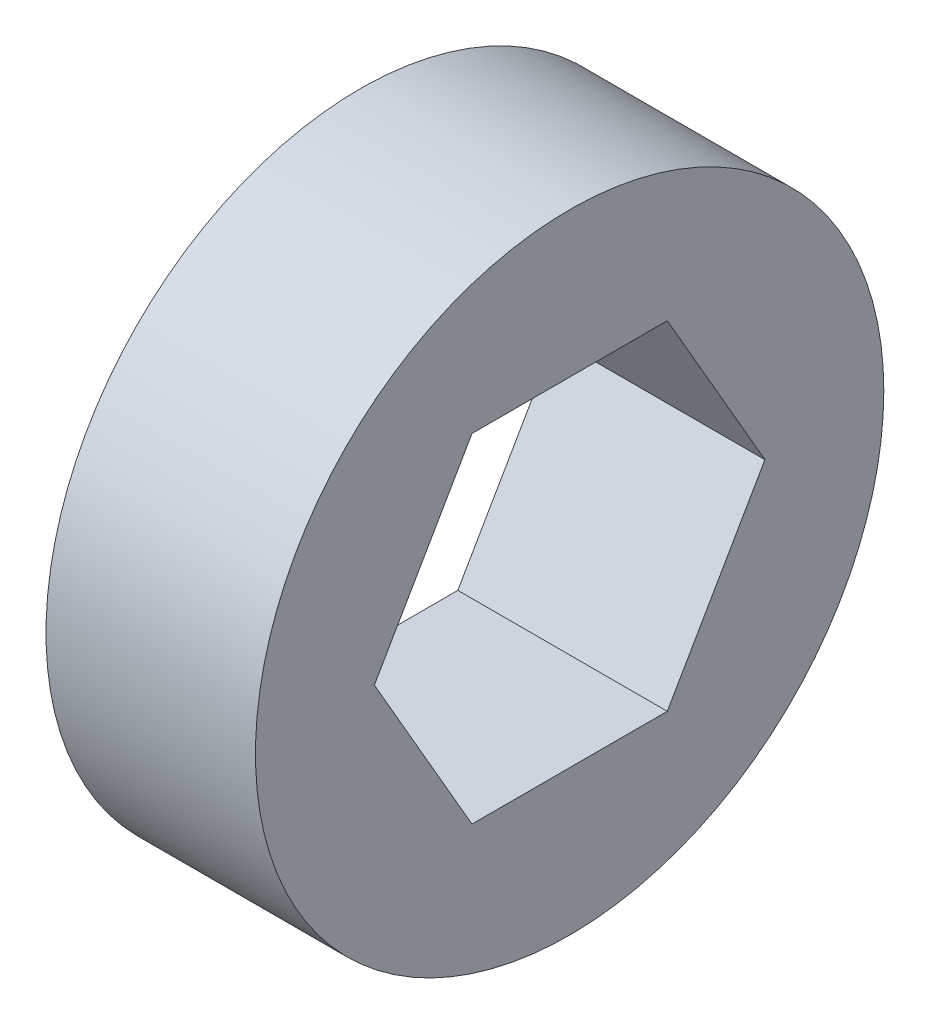
ISO-10303-21;
HEADER;
FILE_DESCRIPTION(('STEP AP214'),'2;1');
FILE_NAME('part.step','',(''),(''),'','','');
FILE_SCHEMA(('AUTOMOTIVE_DESIGN { 1 0 10303 214 1 1 1 1 }'));
ENDSEC;
DATA;
#1=APPLICATION_CONTEXT('core data for automotive mechanical design processes');
#2=APPLICATION_PROTOCOL_DEFINITION('international standard','automotive_design',2000,#1);
#3=PRODUCT_CONTEXT('',#1,'mechanical');
#4=PRODUCT('Part','Part','',(#3));
#5=PRODUCT_RELATED_PRODUCT_CATEGORY('part','',(#4));
#6=PRODUCT_DEFINITION_FORMATION('','',#4);
#7=PRODUCT_DEFINITION_CONTEXT('part definition',#1,'design');
#8=PRODUCT_DEFINITION('design','',#6,#7);
#9=PRODUCT_DEFINITION_SHAPE('','',#8);
#10=(LENGTH_UNIT() NAMED_UNIT(*) SI_UNIT(.MILLI.,.METRE.));
#11=(NAMED_UNIT(*) PLANE_ANGLE_UNIT() SI_UNIT($,.RADIAN.));
#12=(NAMED_UNIT(*) SI_UNIT($,.STERADIAN.) SOLID_ANGLE_UNIT());
#13=UNCERTAINTY_MEASURE_WITH_UNIT(LENGTH_MEASURE(1.E-05),#10,'distance_accuracy_value','');
#14=(GEOMETRIC_REPRESENTATION_CONTEXT(3) GLOBAL_UNCERTAINTY_ASSIGNED_CONTEXT((#13)) GLOBAL_UNIT_ASSIGNED_CONTEXT((#10,
#11,#12)) REPRESENTATION_CONTEXT('',''));
#15=CARTESIAN_POINT('',(0.,0.,0.));
#16=DIRECTION('',(0.,0.,1.));
#17=DIRECTION('',(1.,0.,0.));
#18=AXIS2_PLACEMENT_3D('',#15,#16,#17);
#19=CARTESIAN_POINT('',(3.175,0.,0.));
#20=DIRECTION('',(1.,0.,0.));
#21=DIRECTION('',(0.,0.,-1.));
#22=AXIS2_PLACEMENT_3D('',#19,#20,#21);
#23=PLANE('',#22);
#24=CARTESIAN_POINT('',(3.175,0.,0.));
#25=DIRECTION('',(1.,0.,0.));
#26=DIRECTION('',(0.,0.,-1.));
#27=AXIS2_PLACEMENT_3D('',#24,#25,#26);
#28=CIRCLE('',#27,4.7625);
#29=CARTESIAN_POINT('',(3.175,0.,-4.7625));
#30=VERTEX_POINT('',#29);
#31=EDGE_CURVE('E11',#30,#30,#28,.T.);
#32=ORIENTED_EDGE('',*,*,#31,.T.);
#33=EDGE_LOOP('',(#32));
#34=FACE_BOUND('',#33,.T.);
#35=DIRECTION('',(0.,0.,1.));
#36=VECTOR('',#35,1.);
#37=CARTESIAN_POINT('',(3.175,2.563499953,-1.48003738793214));
#38=LINE('',#37,#36);
#39=CARTESIAN_POINT('',(3.175,2.563499953,-1.48003738793214));
#40=VERTEX_POINT('',#39);
#41=CARTESIAN_POINT('',(3.175,2.563499953,1.48003738793214));
#42=VERTEX_POINT('',#41);
#43=EDGE_CURVE('E102',#40,#42,#38,.T.);
#44=ORIENTED_EDGE('',*,*,#43,.F.);
#45=DIRECTION('',(0.,0.866025403784438,0.5));
#46=VECTOR('',#45,1.);
#47=CARTESIAN_POINT('',(3.175,0.,-2.96007477586429));
#48=LINE('',#47,#46);
#49=CARTESIAN_POINT('',(3.175,0.,-2.96007477586429));
#50=VERTEX_POINT('',#49);
#51=EDGE_CURVE('E94',#50,#40,#48,.T.);
#52=ORIENTED_EDGE('',*,*,#51,.F.);
#53=DIRECTION('',(0.,0.866025403784438,-0.5));
#54=VECTOR('',#53,1.);
#55=CARTESIAN_POINT('',(3.175,-2.563499953,-1.48003738793214));
#56=LINE('',#55,#54);
#57=CARTESIAN_POINT('',(3.175,-2.563499953,-1.48003738793214));
#58=VERTEX_POINT('',#57);
#59=EDGE_CURVE('E122',#58,#50,#56,.T.);
#60=ORIENTED_EDGE('',*,*,#59,.F.);
#61=DIRECTION('',(0.,0.,-1.));
#62=VECTOR('',#61,1.);
#63=CARTESIAN_POINT('',(3.175,-2.563499953,1.48003738793214));
#64=LINE('',#63,#62);
#65=CARTESIAN_POINT('',(3.175,-2.563499953,1.48003738793214));
#66=VERTEX_POINT('',#65);
#67=EDGE_CURVE('E120',#66,#58,#64,.T.);
#68=ORIENTED_EDGE('',*,*,#67,.F.);
#69=DIRECTION('',(0.,-0.866025403784438,-0.5));
#70=VECTOR('',#69,1.);
#71=CARTESIAN_POINT('',(3.175,0.,2.96007477586429));
#72=LINE('',#71,#70);
#73=CARTESIAN_POINT('',(3.175,0.,2.96007477586429));
#74=VERTEX_POINT('',#73);
#75=EDGE_CURVE('E116',#74,#66,#72,.T.);
#76=ORIENTED_EDGE('',*,*,#75,.F.);
#77=DIRECTION('',(0.,-0.866025403784439,0.5));
#78=VECTOR('',#77,1.);
#79=CARTESIAN_POINT('',(3.175,2.563499953,1.48003738793214));
#80=LINE('',#79,#78);
#81=EDGE_CURVE('E114',#42,#74,#80,.T.);
#82=ORIENTED_EDGE('',*,*,#81,.F.);
#83=EDGE_LOOP('',(#44,#52,#60,#68,#76,#82));
#84=FACE_BOUND('',#83,.T.);
#85=ADVANCED_FACE('F41',(#34,#84),#23,.T.);
#86=CARTESIAN_POINT('',(0.,0.,0.));
#87=DIRECTION('',(1.,0.,0.));
#88=DIRECTION('',(0.,0.,-1.));
#89=AXIS2_PLACEMENT_3D('',#86,#87,#88);
#90=PLANE('',#89);
#91=CARTESIAN_POINT('',(0.,0.,0.));
#92=DIRECTION('',(1.,0.,0.));
#93=DIRECTION('',(0.,0.,-1.));
#94=AXIS2_PLACEMENT_3D('',#91,#92,#93);
#95=CIRCLE('',#94,4.7625);
#96=CARTESIAN_POINT('',(0.,0.,-4.7625));
#97=VERTEX_POINT('',#96);
#98=EDGE_CURVE('E45',#97,#97,#95,.T.);
#99=ORIENTED_EDGE('',*,*,#98,.F.);
#100=EDGE_LOOP('',(#99));
#101=FACE_BOUND('',#100,.T.);
#102=DIRECTION('',(0.,0.866025403784438,0.5));
#103=VECTOR('',#102,1.);
#104=CARTESIAN_POINT('',(0.,0.,-2.96007477586429));
#105=LINE('',#104,#103);
#106=CARTESIAN_POINT('',(0.,0.,-2.96007477586429));
#107=VERTEX_POINT('',#106);
#108=CARTESIAN_POINT('',(0.,2.563499953,-1.48003738793214));
#109=VERTEX_POINT('',#108);
#110=EDGE_CURVE('E64',#107,#109,#105,.T.);
#111=ORIENTED_EDGE('',*,*,#110,.T.);
#112=DIRECTION('',(0.,0.,1.));
#113=VECTOR('',#112,1.);
#114=CARTESIAN_POINT('',(0.,2.563499953,-1.48003738793214));
#115=LINE('',#114,#113);
#116=CARTESIAN_POINT('',(0.,2.563499953,1.48003738793214));
#117=VERTEX_POINT('',#116);
#118=EDGE_CURVE('E109',#109,#117,#115,.T.);
#119=ORIENTED_EDGE('',*,*,#118,.T.);
#120=DIRECTION('',(0.,-0.866025403784439,0.5));
#121=VECTOR('',#120,1.);
#122=CARTESIAN_POINT('',(0.,2.563499953,1.48003738793214));
#123=LINE('',#122,#121);
#124=CARTESIAN_POINT('',(0.,0.,2.96007477586429));
#125=VERTEX_POINT('',#124);
#126=EDGE_CURVE('E126',#117,#125,#123,.T.);
#127=ORIENTED_EDGE('',*,*,#126,.T.);
#128=DIRECTION('',(0.,-0.866025403784438,-0.5));
#129=VECTOR('',#128,1.);
#130=CARTESIAN_POINT('',(0.,0.,2.96007477586429));
#131=LINE('',#130,#129);
#132=CARTESIAN_POINT('',(0.,-2.563499953,1.48003738793214));
#133=VERTEX_POINT('',#132);
#134=EDGE_CURVE('E129',#125,#133,#131,.T.);
#135=ORIENTED_EDGE('',*,*,#134,.T.);
#136=DIRECTION('',(0.,0.,-1.));
#137=VECTOR('',#136,1.);
#138=CARTESIAN_POINT('',(0.,-2.563499953,1.48003738793214));
#139=LINE('',#138,#137);
#140=CARTESIAN_POINT('',(0.,-2.563499953,-1.48003738793214));
#141=VERTEX_POINT('',#140);
#142=EDGE_CURVE('E132',#133,#141,#139,.T.);
#143=ORIENTED_EDGE('',*,*,#142,.T.);
#144=DIRECTION('',(0.,0.866025403784438,-0.5));
#145=VECTOR('',#144,1.);
#146=CARTESIAN_POINT('',(0.,-2.563499953,-1.48003738793214));
#147=LINE('',#146,#145);
#148=EDGE_CURVE('E103',#141,#107,#147,.T.);
#149=ORIENTED_EDGE('',*,*,#148,.T.);
#150=EDGE_LOOP('',(#111,#119,#127,#135,#143,#149));
#151=FACE_BOUND('',#150,.T.);
#152=ADVANCED_FACE('F149',(#101,#151),#90,.F.);
#153=CARTESIAN_POINT('',(3.175,0.,0.));
#154=DIRECTION('',(-1.,0.,0.));
#155=DIRECTION('',(0.,0.,1.));
#156=AXIS2_PLACEMENT_3D('',#153,#154,#155);
#157=CYLINDRICAL_SURFACE('',#156,4.7625);
#158=ORIENTED_EDGE('',*,*,#31,.F.);
#159=EDGE_LOOP('',(#158));
#160=FACE_BOUND('',#159,.T.);
#161=ORIENTED_EDGE('',*,*,#98,.T.);
#162=EDGE_LOOP('',(#161));
#163=FACE_BOUND('',#162,.T.);
#164=ADVANCED_FACE('F43',(#160,#163),#157,.T.);
#165=CARTESIAN_POINT('',(3.175,0.,-2.96007477586429));
#166=DIRECTION('',(0.,-0.5,0.866025403784438));
#167=DIRECTION('',(0.,-0.866025403784438,-0.5));
#168=AXIS2_PLACEMENT_3D('',#165,#166,#167);
#169=PLANE('',#168);
#170=ORIENTED_EDGE('',*,*,#110,.F.);
#171=DIRECTION('',(-1.,0.,0.));
#172=VECTOR('',#171,1.);
#173=CARTESIAN_POINT('',(3.175,0.,-2.96007477586429));
#174=LINE('',#173,#172);
#175=EDGE_CURVE('E98',#50,#107,#174,.T.);
#176=ORIENTED_EDGE('',*,*,#175,.F.);
#177=ORIENTED_EDGE('',*,*,#51,.T.);
#178=DIRECTION('',(-1.,0.,0.));
#179=VECTOR('',#178,1.);
#180=CARTESIAN_POINT('',(3.175,2.563499953,-1.48003738793214));
#181=LINE('',#180,#179);
#182=EDGE_CURVE('E97',#40,#109,#181,.T.);
#183=ORIENTED_EDGE('',*,*,#182,.T.);
#184=EDGE_LOOP('',(#170,#176,#177,#183));
#185=FACE_BOUND('',#184,.T.);
#186=ADVANCED_FACE('F96',(#185),#169,.T.);
#187=CARTESIAN_POINT('',(3.175,2.563499953,-1.48003738793214));
#188=DIRECTION('',(0.,-1.,0.));
#189=DIRECTION('',(0.,0.,-1.));
#190=AXIS2_PLACEMENT_3D('',#187,#188,#189);
#191=PLANE('',#190);
#192=ORIENTED_EDGE('',*,*,#118,.F.);
#193=ORIENTED_EDGE('',*,*,#182,.F.);
#194=ORIENTED_EDGE('',*,*,#43,.T.);
#195=DIRECTION('',(-1.,0.,0.));
#196=VECTOR('',#195,1.);
#197=CARTESIAN_POINT('',(3.175,2.563499953,1.48003738793214));
#198=LINE('',#197,#196);
#199=EDGE_CURVE('E110',#42,#117,#198,.T.);
#200=ORIENTED_EDGE('',*,*,#199,.T.);
#201=EDGE_LOOP('',(#192,#193,#194,#200));
#202=FACE_BOUND('',#201,.T.);
#203=ADVANCED_FACE('F106',(#202),#191,.T.);
#204=CARTESIAN_POINT('',(3.175,2.563499953,1.48003738793214));
#205=DIRECTION('',(0.,-0.5,-0.866025403784439));
#206=DIRECTION('',(0.,0.866025403784439,-0.5));
#207=AXIS2_PLACEMENT_3D('',#204,#205,#206);
#208=PLANE('',#207);
#209=ORIENTED_EDGE('',*,*,#126,.F.);
#210=ORIENTED_EDGE('',*,*,#199,.F.);
#211=ORIENTED_EDGE('',*,*,#81,.T.);
#212=DIRECTION('',(-1.,0.,0.));
#213=VECTOR('',#212,1.);
#214=CARTESIAN_POINT('',(3.175,0.,2.96007477586429));
#215=LINE('',#214,#213);
#216=EDGE_CURVE('E141',#74,#125,#215,.T.);
#217=ORIENTED_EDGE('',*,*,#216,.T.);
#218=EDGE_LOOP('',(#209,#210,#211,#217));
#219=FACE_BOUND('',#218,.T.);
#220=ADVANCED_FACE('F145',(#219),#208,.T.);
#221=CARTESIAN_POINT('',(3.175,0.,2.96007477586429));
#222=DIRECTION('',(0.,0.5,-0.866025403784438));
#223=DIRECTION('',(0.,0.866025403784439,0.5));
#224=AXIS2_PLACEMENT_3D('',#221,#222,#223);
#225=PLANE('',#224);
#226=ORIENTED_EDGE('',*,*,#134,.F.);
#227=ORIENTED_EDGE('',*,*,#216,.F.);
#228=ORIENTED_EDGE('',*,*,#75,.T.);
#229=DIRECTION('',(-1.,0.,0.));
#230=VECTOR('',#229,1.);
#231=CARTESIAN_POINT('',(3.175,-2.563499953,1.48003738793214));
#232=LINE('',#231,#230);
#233=EDGE_CURVE('E139',#66,#133,#232,.T.);
#234=ORIENTED_EDGE('',*,*,#233,.T.);
#235=EDGE_LOOP('',(#226,#227,#228,#234));
#236=FACE_BOUND('',#235,.T.);
#237=ADVANCED_FACE('F157',(#236),#225,.T.);
#238=CARTESIAN_POINT('',(3.175,-2.563499953,1.48003738793214));
#239=DIRECTION('',(0.,1.,0.));
#240=DIRECTION('',(0.,0.,1.));
#241=AXIS2_PLACEMENT_3D('',#238,#239,#240);
#242=PLANE('',#241);
#243=ORIENTED_EDGE('',*,*,#142,.F.);
#244=ORIENTED_EDGE('',*,*,#233,.F.);
#245=ORIENTED_EDGE('',*,*,#67,.T.);
#246=DIRECTION('',(-1.,0.,0.));
#247=VECTOR('',#246,1.);
#248=CARTESIAN_POINT('',(3.175,-2.563499953,-1.48003738793214));
#249=LINE('',#248,#247);
#250=EDGE_CURVE('E56',#58,#141,#249,.T.);
#251=ORIENTED_EDGE('',*,*,#250,.T.);
#252=EDGE_LOOP('',(#243,#244,#245,#251));
#253=FACE_BOUND('',#252,.T.);
#254=ADVANCED_FACE('F155',(#253),#242,.T.);
#255=CARTESIAN_POINT('',(3.175,-2.563499953,-1.48003738793214));
#256=DIRECTION('',(0.,0.5,0.866025403784438));
#257=DIRECTION('',(0.,-0.866025403784439,0.5));
#258=AXIS2_PLACEMENT_3D('',#255,#256,#257);
#259=PLANE('',#258);
#260=ORIENTED_EDGE('',*,*,#148,.F.);
#261=ORIENTED_EDGE('',*,*,#250,.F.);
#262=ORIENTED_EDGE('',*,*,#59,.T.);
#263=ORIENTED_EDGE('',*,*,#175,.T.);
#264=EDGE_LOOP('',(#260,#261,#262,#263));
#265=FACE_BOUND('',#264,.T.);
#266=ADVANCED_FACE('F151',(#265),#259,.T.);
#267=CLOSED_SHELL('',(#85,#152,#164,#186,#203,#220,#237,#254,#266));
#268=MANIFOLD_SOLID_BREP('B2',#267);
#269=ADVANCED_BREP_SHAPE_REPRESENTATION('',(#18,#268),#14);
#270=SHAPE_DEFINITION_REPRESENTATION(#9,#269);
ENDSEC;
END-ISO-10303-21;
